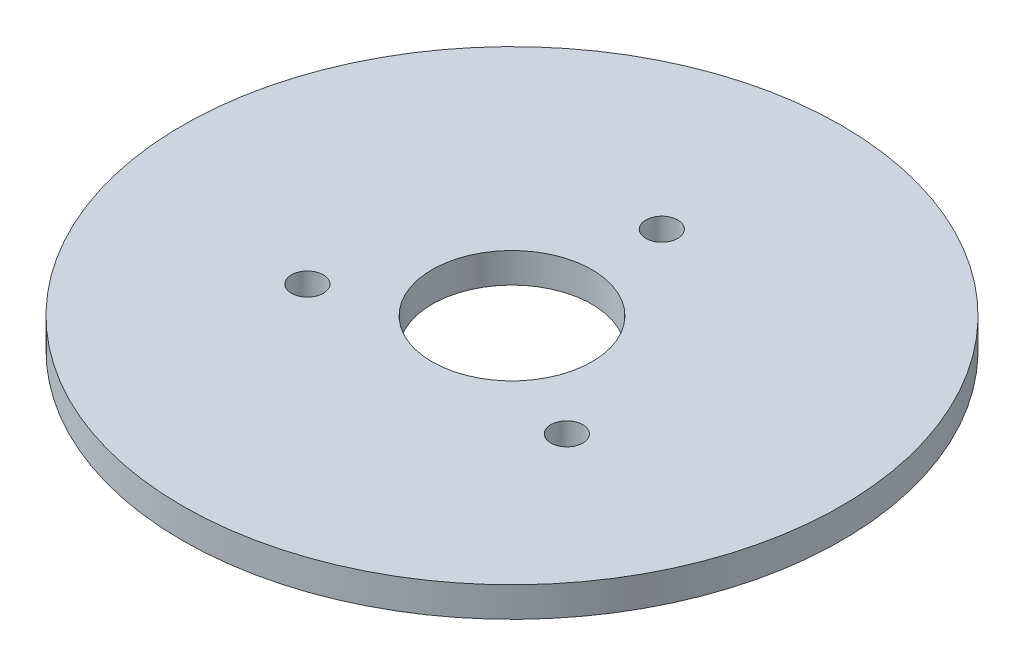
ISO-10303-21;
HEADER;
FILE_DESCRIPTION(('STEP AP214'),'2;1');
FILE_NAME('part.step','',(''),(''),'','','');
FILE_SCHEMA(('AUTOMOTIVE_DESIGN { 1 0 10303 214 1 1 1 1 }'));
ENDSEC;
DATA;
#1=APPLICATION_CONTEXT('core data for automotive mechanical design processes');
#2=APPLICATION_PROTOCOL_DEFINITION('international standard','automotive_design',2000,#1);
#3=PRODUCT_CONTEXT('',#1,'mechanical');
#4=PRODUCT('Part','Part','',(#3));
#5=PRODUCT_RELATED_PRODUCT_CATEGORY('part','',(#4));
#6=PRODUCT_DEFINITION_FORMATION('','',#4);
#7=PRODUCT_DEFINITION_CONTEXT('part definition',#1,'design');
#8=PRODUCT_DEFINITION('design','',#6,#7);
#9=PRODUCT_DEFINITION_SHAPE('','',#8);
#10=(LENGTH_UNIT() NAMED_UNIT(*) SI_UNIT(.MILLI.,.METRE.));
#11=(NAMED_UNIT(*) PLANE_ANGLE_UNIT() SI_UNIT($,.RADIAN.));
#12=(NAMED_UNIT(*) SI_UNIT($,.STERADIAN.) SOLID_ANGLE_UNIT());
#13=UNCERTAINTY_MEASURE_WITH_UNIT(LENGTH_MEASURE(1.E-05),#10,'distance_accuracy_value','');
#14=(GEOMETRIC_REPRESENTATION_CONTEXT(3) GLOBAL_UNCERTAINTY_ASSIGNED_CONTEXT((#13)) GLOBAL_UNIT_ASSIGNED_CONTEXT((#10,
#11,#12)) REPRESENTATION_CONTEXT('',''));
#15=CARTESIAN_POINT('',(0.,0.,0.));
#16=DIRECTION('',(0.,0.,1.));
#17=DIRECTION('',(1.,0.,0.));
#18=AXIS2_PLACEMENT_3D('',#15,#16,#17);
#19=CARTESIAN_POINT('',(0.,3.,0.));
#20=DIRECTION('',(0.,1.,0.));
#21=DIRECTION('',(0.,0.,1.));
#22=AXIS2_PLACEMENT_3D('',#19,#20,#21);
#23=PLANE('',#22);
#24=CARTESIAN_POINT('',(12.9903810567666,3.,7.5));
#25=DIRECTION('',(0.,1.,0.));
#26=DIRECTION('',(0.,0.,1.));
#27=AXIS2_PLACEMENT_3D('',#24,#25,#26);
#28=CIRCLE('',#27,1.6);
#29=CARTESIAN_POINT('',(12.9903810567666,3.,9.1));
#30=VERTEX_POINT('',#29);
#31=EDGE_CURVE('E61',#30,#30,#28,.T.);
#32=ORIENTED_EDGE('',*,*,#31,.F.);
#33=EDGE_LOOP('',(#32));
#34=FACE_BOUND('',#33,.T.);
#35=CARTESIAN_POINT('',(0.,3.,-15.));
#36=DIRECTION('',(0.,1.,0.));
#37=DIRECTION('',(0.,0.,1.));
#38=AXIS2_PLACEMENT_3D('',#35,#36,#37);
#39=CIRCLE('',#38,1.6);
#40=CARTESIAN_POINT('',(0.,3.,-13.4));
#41=VERTEX_POINT('',#40);
#42=EDGE_CURVE('E50',#41,#41,#39,.T.);
#43=ORIENTED_EDGE('',*,*,#42,.F.);
#44=EDGE_LOOP('',(#43));
#45=FACE_BOUND('',#44,.T.);
#46=CARTESIAN_POINT('',(0.,3.,0.));
#47=DIRECTION('',(0.,1.,0.));
#48=DIRECTION('',(0.,0.,1.));
#49=AXIS2_PLACEMENT_3D('',#46,#47,#48);
#50=CIRCLE('',#49,33.);
#51=CARTESIAN_POINT('',(0.,3.,33.));
#52=VERTEX_POINT('',#51);
#53=EDGE_CURVE('E10',#52,#52,#50,.T.);
#54=ORIENTED_EDGE('',*,*,#53,.T.);
#55=EDGE_LOOP('',(#54));
#56=FACE_BOUND('',#55,.T.);
#57=CARTESIAN_POINT('',(0.,3.,0.));
#58=DIRECTION('',(0.,1.,0.));
#59=DIRECTION('',(0.,0.,1.));
#60=AXIS2_PLACEMENT_3D('',#57,#58,#59);
#61=CIRCLE('',#60,8.);
#62=CARTESIAN_POINT('',(0.,3.,8.));
#63=VERTEX_POINT('',#62);
#64=EDGE_CURVE('E55',#63,#63,#61,.T.);
#65=ORIENTED_EDGE('',*,*,#64,.F.);
#66=EDGE_LOOP('',(#65));
#67=FACE_BOUND('',#66,.T.);
#68=CARTESIAN_POINT('',(-12.9903810567666,3.,7.50000000000001));
#69=DIRECTION('',(0.,1.,0.));
#70=DIRECTION('',(0.,0.,1.));
#71=AXIS2_PLACEMENT_3D('',#68,#69,#70);
#72=CIRCLE('',#71,1.6);
#73=CARTESIAN_POINT('',(-12.9903810567666,3.,9.10000000000001));
#74=VERTEX_POINT('',#73);
#75=EDGE_CURVE('E67',#74,#74,#72,.T.);
#76=ORIENTED_EDGE('',*,*,#75,.F.);
#77=EDGE_LOOP('',(#76));
#78=FACE_BOUND('',#77,.T.);
#79=ADVANCED_FACE('F39',(#34,#45,#56,#67,#78),#23,.T.);
#80=CARTESIAN_POINT('',(0.,0.,0.));
#81=DIRECTION('',(0.,1.,0.));
#82=DIRECTION('',(0.,0.,1.));
#83=AXIS2_PLACEMENT_3D('',#80,#81,#82);
#84=PLANE('',#83);
#85=CARTESIAN_POINT('',(0.,0.,0.));
#86=DIRECTION('',(0.,1.,0.));
#87=DIRECTION('',(0.,0.,1.));
#88=AXIS2_PLACEMENT_3D('',#85,#86,#87);
#89=CIRCLE('',#88,33.);
#90=CARTESIAN_POINT('',(0.,0.,33.));
#91=VERTEX_POINT('',#90);
#92=EDGE_CURVE('E43',#91,#91,#89,.T.);
#93=ORIENTED_EDGE('',*,*,#92,.F.);
#94=EDGE_LOOP('',(#93));
#95=FACE_BOUND('',#94,.T.);
#96=CARTESIAN_POINT('',(0.,0.,-15.));
#97=DIRECTION('',(0.,1.,0.));
#98=DIRECTION('',(0.,0.,1.));
#99=AXIS2_PLACEMENT_3D('',#96,#97,#98);
#100=CIRCLE('',#99,1.6);
#101=CARTESIAN_POINT('',(0.,0.,-13.4));
#102=VERTEX_POINT('',#101);
#103=EDGE_CURVE('E52',#102,#102,#100,.T.);
#104=ORIENTED_EDGE('',*,*,#103,.T.);
#105=EDGE_LOOP('',(#104));
#106=FACE_BOUND('',#105,.T.);
#107=CARTESIAN_POINT('',(0.,0.,0.));
#108=DIRECTION('',(0.,1.,0.));
#109=DIRECTION('',(0.,0.,1.));
#110=AXIS2_PLACEMENT_3D('',#107,#108,#109);
#111=CIRCLE('',#110,8.);
#112=CARTESIAN_POINT('',(0.,0.,8.));
#113=VERTEX_POINT('',#112);
#114=EDGE_CURVE('E58',#113,#113,#111,.T.);
#115=ORIENTED_EDGE('',*,*,#114,.T.);
#116=EDGE_LOOP('',(#115));
#117=FACE_BOUND('',#116,.T.);
#118=CARTESIAN_POINT('',(12.9903810567666,0.,7.5));
#119=DIRECTION('',(0.,1.,0.));
#120=DIRECTION('',(0.,0.,1.));
#121=AXIS2_PLACEMENT_3D('',#118,#119,#120);
#122=CIRCLE('',#121,1.6);
#123=CARTESIAN_POINT('',(12.9903810567666,0.,9.1));
#124=VERTEX_POINT('',#123);
#125=EDGE_CURVE('E64',#124,#124,#122,.T.);
#126=ORIENTED_EDGE('',*,*,#125,.T.);
#127=EDGE_LOOP('',(#126));
#128=FACE_BOUND('',#127,.T.);
#129=CARTESIAN_POINT('',(-12.9903810567666,0.,7.50000000000001));
#130=DIRECTION('',(0.,1.,0.));
#131=DIRECTION('',(0.,0.,1.));
#132=AXIS2_PLACEMENT_3D('',#129,#130,#131);
#133=CIRCLE('',#132,1.6);
#134=CARTESIAN_POINT('',(-12.9903810567666,0.,9.10000000000001));
#135=VERTEX_POINT('',#134);
#136=EDGE_CURVE('E70',#135,#135,#133,.T.);
#137=ORIENTED_EDGE('',*,*,#136,.T.);
#138=EDGE_LOOP('',(#137));
#139=FACE_BOUND('',#138,.T.);
#140=ADVANCED_FACE('F80',(#95,#106,#117,#128,#139),#84,.F.);
#141=CARTESIAN_POINT('',(0.,3.,0.));
#142=DIRECTION('',(0.,-1.,0.));
#143=DIRECTION('',(0.,0.,-1.));
#144=AXIS2_PLACEMENT_3D('',#141,#142,#143);
#145=CYLINDRICAL_SURFACE('',#144,33.);
#146=ORIENTED_EDGE('',*,*,#53,.F.);
#147=EDGE_LOOP('',(#146));
#148=FACE_BOUND('',#147,.T.);
#149=ORIENTED_EDGE('',*,*,#92,.T.);
#150=EDGE_LOOP('',(#149));
#151=FACE_BOUND('',#150,.T.);
#152=ADVANCED_FACE('F41',(#148,#151),#145,.T.);
#153=CARTESIAN_POINT('',(0.,3.,-15.));
#154=DIRECTION('',(0.,-1.,0.));
#155=DIRECTION('',(0.,0.,-1.));
#156=AXIS2_PLACEMENT_3D('',#153,#154,#155);
#157=CYLINDRICAL_SURFACE('',#156,1.6);
#158=ORIENTED_EDGE('',*,*,#42,.T.);
#159=EDGE_LOOP('',(#158));
#160=FACE_BOUND('',#159,.T.);
#161=ORIENTED_EDGE('',*,*,#103,.F.);
#162=EDGE_LOOP('',(#161));
#163=FACE_BOUND('',#162,.T.);
#164=ADVANCED_FACE('F90',(#160,#163),#157,.F.);
#165=CARTESIAN_POINT('',(0.,3.,0.));
#166=DIRECTION('',(0.,-1.,0.));
#167=DIRECTION('',(0.,0.,-1.));
#168=AXIS2_PLACEMENT_3D('',#165,#166,#167);
#169=CYLINDRICAL_SURFACE('',#168,8.);
#170=ORIENTED_EDGE('',*,*,#64,.T.);
#171=EDGE_LOOP('',(#170));
#172=FACE_BOUND('',#171,.T.);
#173=ORIENTED_EDGE('',*,*,#114,.F.);
#174=EDGE_LOOP('',(#173));
#175=FACE_BOUND('',#174,.T.);
#176=ADVANCED_FACE('F93',(#172,#175),#169,.F.);
#177=CARTESIAN_POINT('',(12.9903810567666,3.,7.5));
#178=DIRECTION('',(0.,-1.,0.));
#179=DIRECTION('',(0.,0.,-1.));
#180=AXIS2_PLACEMENT_3D('',#177,#178,#179);
#181=CYLINDRICAL_SURFACE('',#180,1.6);
#182=ORIENTED_EDGE('',*,*,#31,.T.);
#183=EDGE_LOOP('',(#182));
#184=FACE_BOUND('',#183,.T.);
#185=ORIENTED_EDGE('',*,*,#125,.F.);
#186=EDGE_LOOP('',(#185));
#187=FACE_BOUND('',#186,.T.);
#188=ADVANCED_FACE('F97',(#184,#187),#181,.F.);
#189=CARTESIAN_POINT('',(-12.9903810567666,3.,7.50000000000001));
#190=DIRECTION('',(0.,-1.,0.));
#191=DIRECTION('',(0.,0.,-1.));
#192=AXIS2_PLACEMENT_3D('',#189,#190,#191);
#193=CYLINDRICAL_SURFACE('',#192,1.6);
#194=ORIENTED_EDGE('',*,*,#75,.T.);
#195=EDGE_LOOP('',(#194));
#196=FACE_BOUND('',#195,.T.);
#197=ORIENTED_EDGE('',*,*,#136,.F.);
#198=EDGE_LOOP('',(#197));
#199=FACE_BOUND('',#198,.T.);
#200=ADVANCED_FACE('F76',(#196,#199),#193,.F.);
#201=CLOSED_SHELL('',(#79,#140,#152,#164,#176,#188,#200));
#202=MANIFOLD_SOLID_BREP('B2',#201);
#203=ADVANCED_BREP_SHAPE_REPRESENTATION('',(#18,#202),#14);
#204=SHAPE_DEFINITION_REPRESENTATION(#9,#203);
ENDSEC;
END-ISO-10303-21;
